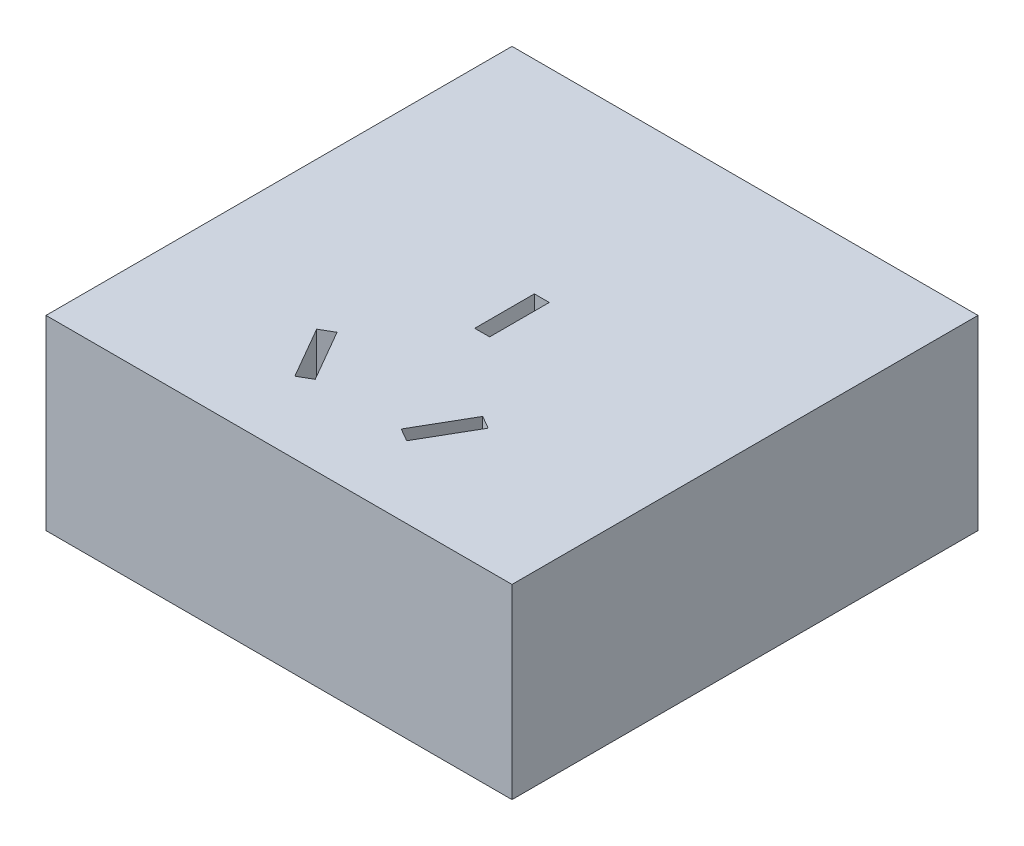
ISO-10303-21;
HEADER;
FILE_DESCRIPTION(('STEP AP214'),'2;1');
FILE_NAME('part.step','',(''),(''),'','','');
FILE_SCHEMA(('AUTOMOTIVE_DESIGN { 1 0 10303 214 1 1 1 1 }'));
ENDSEC;
DATA;
#1=APPLICATION_CONTEXT('core data for automotive mechanical design processes');
#2=APPLICATION_PROTOCOL_DEFINITION('international standard','automotive_design',2000,#1);
#3=PRODUCT_CONTEXT('',#1,'mechanical');
#4=PRODUCT('Part','Part','',(#3));
#5=PRODUCT_RELATED_PRODUCT_CATEGORY('part','',(#4));
#6=PRODUCT_DEFINITION_FORMATION('','',#4);
#7=PRODUCT_DEFINITION_CONTEXT('part definition',#1,'design');
#8=PRODUCT_DEFINITION('design','',#6,#7);
#9=PRODUCT_DEFINITION_SHAPE('','',#8);
#10=(LENGTH_UNIT() NAMED_UNIT(*) SI_UNIT(.MILLI.,.METRE.));
#11=(NAMED_UNIT(*) PLANE_ANGLE_UNIT() SI_UNIT($,.RADIAN.));
#12=(NAMED_UNIT(*) SI_UNIT($,.STERADIAN.) SOLID_ANGLE_UNIT());
#13=UNCERTAINTY_MEASURE_WITH_UNIT(LENGTH_MEASURE(1.E-05),#10,'distance_accuracy_value','');
#14=(GEOMETRIC_REPRESENTATION_CONTEXT(3) GLOBAL_UNCERTAINTY_ASSIGNED_CONTEXT((#13)) GLOBAL_UNIT_ASSIGNED_CONTEXT((#10,
#11,#12)) REPRESENTATION_CONTEXT('',''));
#15=CARTESIAN_POINT('',(0.,0.,0.));
#16=DIRECTION('',(0.,0.,1.));
#17=DIRECTION('',(1.,0.,0.));
#18=AXIS2_PLACEMENT_3D('',#15,#16,#17);
#19=CARTESIAN_POINT('',(25.,20.,-25.));
#20=DIRECTION('',(-1.,0.,0.));
#21=DIRECTION('',(0.,0.,1.));
#22=AXIS2_PLACEMENT_3D('',#19,#20,#21);
#23=PLANE('',#22);
#24=DIRECTION('',(0.,0.,-1.));
#25=VECTOR('',#24,1.);
#26=CARTESIAN_POINT('',(25.,0.,-25.));
#27=LINE('',#26,#25);
#28=CARTESIAN_POINT('',(25.,0.,25.));
#29=VERTEX_POINT('',#28);
#30=CARTESIAN_POINT('',(25.,0.,-25.));
#31=VERTEX_POINT('',#30);
#32=EDGE_CURVE('E198',#29,#31,#27,.T.);
#33=ORIENTED_EDGE('',*,*,#32,.T.);
#34=DIRECTION('',(0.,-1.,0.));
#35=VECTOR('',#34,1.);
#36=CARTESIAN_POINT('',(25.,20.,-25.));
#37=LINE('',#36,#35);
#38=CARTESIAN_POINT('',(25.,20.,-25.));
#39=VERTEX_POINT('',#38);
#40=EDGE_CURVE('E11',#39,#31,#37,.T.);
#41=ORIENTED_EDGE('',*,*,#40,.F.);
#42=DIRECTION('',(0.,0.,-1.));
#43=VECTOR('',#42,1.);
#44=CARTESIAN_POINT('',(25.,20.,-25.));
#45=LINE('',#44,#43);
#46=CARTESIAN_POINT('',(25.,20.,25.));
#47=VERTEX_POINT('',#46);
#48=EDGE_CURVE('E289',#47,#39,#45,.T.);
#49=ORIENTED_EDGE('',*,*,#48,.F.);
#50=DIRECTION('',(0.,-1.,0.));
#51=VECTOR('',#50,1.);
#52=CARTESIAN_POINT('',(25.,20.,25.));
#53=LINE('',#52,#51);
#54=EDGE_CURVE('E303',#47,#29,#53,.T.);
#55=ORIENTED_EDGE('',*,*,#54,.T.);
#56=EDGE_LOOP('',(#33,#41,#49,#55));
#57=FACE_BOUND('',#56,.T.);
#58=ADVANCED_FACE('F38',(#57),#23,.F.);
#59=CARTESIAN_POINT('',(-25.,20.,-25.));
#60=DIRECTION('',(0.,0.,1.));
#61=DIRECTION('',(1.,0.,0.));
#62=AXIS2_PLACEMENT_3D('',#59,#60,#61);
#63=PLANE('',#62);
#64=DIRECTION('',(-1.,0.,0.));
#65=VECTOR('',#64,1.);
#66=CARTESIAN_POINT('',(-25.,0.,-25.));
#67=LINE('',#66,#65);
#68=CARTESIAN_POINT('',(-25.,0.,-25.));
#69=VERTEX_POINT('',#68);
#70=EDGE_CURVE('E307',#31,#69,#67,.T.);
#71=ORIENTED_EDGE('',*,*,#70,.T.);
#72=DIRECTION('',(0.,-1.,0.));
#73=VECTOR('',#72,1.);
#74=CARTESIAN_POINT('',(-25.,20.,-25.));
#75=LINE('',#74,#73);
#76=CARTESIAN_POINT('',(-25.,20.,-25.));
#77=VERTEX_POINT('',#76);
#78=EDGE_CURVE('E46',#77,#69,#75,.T.);
#79=ORIENTED_EDGE('',*,*,#78,.F.);
#80=DIRECTION('',(-1.,0.,0.));
#81=VECTOR('',#80,1.);
#82=CARTESIAN_POINT('',(-25.,20.,-25.));
#83=LINE('',#82,#81);
#84=EDGE_CURVE('E293',#39,#77,#83,.T.);
#85=ORIENTED_EDGE('',*,*,#84,.F.);
#86=ORIENTED_EDGE('',*,*,#40,.T.);
#87=EDGE_LOOP('',(#71,#79,#85,#86));
#88=FACE_BOUND('',#87,.T.);
#89=ADVANCED_FACE('F342',(#88),#63,.F.);
#90=CARTESIAN_POINT('',(-25.,20.,-25.));
#91=DIRECTION('',(1.,0.,0.));
#92=DIRECTION('',(0.,0.,-1.));
#93=AXIS2_PLACEMENT_3D('',#90,#91,#92);
#94=PLANE('',#93);
#95=DIRECTION('',(0.,0.,1.));
#96=VECTOR('',#95,1.);
#97=CARTESIAN_POINT('',(-25.,0.,-25.));
#98=LINE('',#97,#96);
#99=CARTESIAN_POINT('',(-25.,0.,25.));
#100=VERTEX_POINT('',#99);
#101=EDGE_CURVE('E310',#69,#100,#98,.T.);
#102=ORIENTED_EDGE('',*,*,#101,.T.);
#103=DIRECTION('',(0.,-1.,0.));
#104=VECTOR('',#103,1.);
#105=CARTESIAN_POINT('',(-25.,20.,25.));
#106=LINE('',#105,#104);
#107=CARTESIAN_POINT('',(-25.,20.,25.));
#108=VERTEX_POINT('',#107);
#109=EDGE_CURVE('E318',#108,#100,#106,.T.);
#110=ORIENTED_EDGE('',*,*,#109,.F.);
#111=DIRECTION('',(0.,0.,1.));
#112=VECTOR('',#111,1.);
#113=CARTESIAN_POINT('',(-25.,20.,-25.));
#114=LINE('',#113,#112);
#115=EDGE_CURVE('E297',#77,#108,#114,.T.);
#116=ORIENTED_EDGE('',*,*,#115,.F.);
#117=ORIENTED_EDGE('',*,*,#78,.T.);
#118=EDGE_LOOP('',(#102,#110,#116,#117));
#119=FACE_BOUND('',#118,.T.);
#120=ADVANCED_FACE('F327',(#119),#94,.F.);
#121=CARTESIAN_POINT('',(-25.,20.,25.));
#122=DIRECTION('',(0.,0.,-1.));
#123=DIRECTION('',(-1.,0.,0.));
#124=AXIS2_PLACEMENT_3D('',#121,#122,#123);
#125=PLANE('',#124);
#126=DIRECTION('',(1.,0.,0.));
#127=VECTOR('',#126,1.);
#128=CARTESIAN_POINT('',(-25.,0.,25.));
#129=LINE('',#128,#127);
#130=EDGE_CURVE('E294',#100,#29,#129,.T.);
#131=ORIENTED_EDGE('',*,*,#130,.T.);
#132=ORIENTED_EDGE('',*,*,#54,.F.);
#133=DIRECTION('',(1.,0.,0.));
#134=VECTOR('',#133,1.);
#135=CARTESIAN_POINT('',(-25.,20.,25.));
#136=LINE('',#135,#134);
#137=EDGE_CURVE('E300',#108,#47,#136,.T.);
#138=ORIENTED_EDGE('',*,*,#137,.F.);
#139=ORIENTED_EDGE('',*,*,#109,.T.);
#140=EDGE_LOOP('',(#131,#132,#138,#139));
#141=FACE_BOUND('',#140,.T.);
#142=ADVANCED_FACE('F335',(#141),#125,.F.);
#143=CARTESIAN_POINT('',(0.,20.,0.));
#144=DIRECTION('',(0.,1.,0.));
#145=DIRECTION('',(0.,0.,1.));
#146=AXIS2_PLACEMENT_3D('',#143,#144,#145);
#147=PLANE('',#146);
#148=DIRECTION('',(0.,0.,-1.));
#149=VECTOR('',#148,1.);
#150=CARTESIAN_POINT('',(0.8,20.,-3.2));
#151=LINE('',#150,#149);
#152=CARTESIAN_POINT('',(0.800000000000001,20.,3.2));
#153=VERTEX_POINT('',#152);
#154=CARTESIAN_POINT('',(0.8,20.,-3.2));
#155=VERTEX_POINT('',#154);
#156=EDGE_CURVE('E53',#153,#155,#151,.T.);
#157=ORIENTED_EDGE('',*,*,#156,.F.);
#158=DIRECTION('',(1.,0.,0.));
#159=VECTOR('',#158,1.);
#160=CARTESIAN_POINT('',(0.800000000000001,20.,3.2));
#161=LINE('',#160,#159);
#162=CARTESIAN_POINT('',(-0.799999999999995,20.,3.2));
#163=VERTEX_POINT('',#162);
#164=EDGE_CURVE('E175',#163,#153,#161,.T.);
#165=ORIENTED_EDGE('',*,*,#164,.F.);
#166=DIRECTION('',(0.,0.,1.));
#167=VECTOR('',#166,1.);
#168=CARTESIAN_POINT('',(-0.8,20.,-3.2));
#169=LINE('',#168,#167);
#170=CARTESIAN_POINT('',(-0.8,20.,-3.2));
#171=VERTEX_POINT('',#170);
#172=EDGE_CURVE('E179',#171,#163,#169,.T.);
#173=ORIENTED_EDGE('',*,*,#172,.F.);
#174=DIRECTION('',(-1.,0.,0.));
#175=VECTOR('',#174,1.);
#176=CARTESIAN_POINT('',(-0.8,20.,-3.2));
#177=LINE('',#176,#175);
#178=EDGE_CURVE('E188',#155,#171,#177,.T.);
#179=ORIENTED_EDGE('',*,*,#178,.F.);
#180=EDGE_LOOP('',(#157,#165,#173,#179));
#181=FACE_BOUND('',#180,.T.);
#182=DIRECTION('',(0.866025403784439,0.,0.499999999999999));
#183=VECTOR('',#182,1.);
#184=CARTESIAN_POINT('',(6.,20.,17.3));
#185=LINE('',#184,#183);
#186=CARTESIAN_POINT('',(4.6143593539449,20.,16.5));
#187=VERTEX_POINT('',#186);
#188=CARTESIAN_POINT('',(6.,20.,17.3));
#189=VERTEX_POINT('',#188);
#190=EDGE_CURVE('E61',#187,#189,#185,.T.);
#191=ORIENTED_EDGE('',*,*,#190,.F.);
#192=DIRECTION('',(-0.5,0.,0.866025403784439));
#193=VECTOR('',#192,1.);
#194=CARTESIAN_POINT('',(4.6143593539449,20.,16.5));
#195=LINE('',#194,#193);
#196=CARTESIAN_POINT('',(7.81435935394489,20.,10.9574374157796));
#197=VERTEX_POINT('',#196);
#198=EDGE_CURVE('E209',#197,#187,#195,.T.);
#199=ORIENTED_EDGE('',*,*,#198,.F.);
#200=DIRECTION('',(-0.866025403784439,0.,-0.5));
#201=VECTOR('',#200,1.);
#202=CARTESIAN_POINT('',(7.81435935394489,20.,10.9574374157796));
#203=LINE('',#202,#201);
#204=CARTESIAN_POINT('',(9.2,20.,11.7574374157796));
#205=VERTEX_POINT('',#204);
#206=EDGE_CURVE('E229',#205,#197,#203,.T.);
#207=ORIENTED_EDGE('',*,*,#206,.F.);
#208=DIRECTION('',(0.5,0.,-0.866025403784439));
#209=VECTOR('',#208,1.);
#210=CARTESIAN_POINT('',(9.2,20.,11.7574374157796));
#211=LINE('',#210,#209);
#212=EDGE_CURVE('E224',#189,#205,#211,.T.);
#213=ORIENTED_EDGE('',*,*,#212,.F.);
#214=EDGE_LOOP('',(#191,#199,#207,#213));
#215=FACE_BOUND('',#214,.T.);
#216=DIRECTION('',(0.5,0.,0.866025403784439));
#217=VECTOR('',#216,1.);
#218=CARTESIAN_POINT('',(-9.2,20.,11.7574374157796));
#219=LINE('',#218,#217);
#220=CARTESIAN_POINT('',(-9.2,20.,11.7574374157796));
#221=VERTEX_POINT('',#220);
#222=CARTESIAN_POINT('',(-6.,20.,17.3));
#223=VERTEX_POINT('',#222);
#224=EDGE_CURVE('E264',#221,#223,#219,.T.);
#225=ORIENTED_EDGE('',*,*,#224,.F.);
#226=DIRECTION('',(-0.866025403784439,0.,0.5));
#227=VECTOR('',#226,1.);
#228=CARTESIAN_POINT('',(-7.81435935394489,20.,10.9574374157796));
#229=LINE('',#228,#227);
#230=CARTESIAN_POINT('',(-7.81435935394489,20.,10.9574374157796));
#231=VERTEX_POINT('',#230);
#232=EDGE_CURVE('E251',#231,#221,#229,.T.);
#233=ORIENTED_EDGE('',*,*,#232,.F.);
#234=DIRECTION('',(-0.5,0.,-0.866025403784439));
#235=VECTOR('',#234,1.);
#236=CARTESIAN_POINT('',(-4.6143593539449,20.,16.5));
#237=LINE('',#236,#235);
#238=CARTESIAN_POINT('',(-4.6143593539449,20.,16.5));
#239=VERTEX_POINT('',#238);
#240=EDGE_CURVE('E271',#239,#231,#237,.T.);
#241=ORIENTED_EDGE('',*,*,#240,.F.);
#242=DIRECTION('',(0.866025403784439,0.,-0.499999999999999));
#243=VECTOR('',#242,1.);
#244=CARTESIAN_POINT('',(-6.,20.,17.3));
#245=LINE('',#244,#243);
#246=EDGE_CURVE('E267',#223,#239,#245,.T.);
#247=ORIENTED_EDGE('',*,*,#246,.F.);
#248=EDGE_LOOP('',(#225,#233,#241,#247));
#249=FACE_BOUND('',#248,.T.);
#250=ORIENTED_EDGE('',*,*,#48,.T.);
#251=ORIENTED_EDGE('',*,*,#84,.T.);
#252=ORIENTED_EDGE('',*,*,#115,.T.);
#253=ORIENTED_EDGE('',*,*,#137,.T.);
#254=EDGE_LOOP('',(#250,#251,#252,#253));
#255=FACE_BOUND('',#254,.T.);
#256=ADVANCED_FACE('F341',(#181,#215,#249,#255),#147,.T.);
#257=CARTESIAN_POINT('',(0.,0.,0.));
#258=DIRECTION('',(0.,1.,0.));
#259=DIRECTION('',(0.,0.,1.));
#260=AXIS2_PLACEMENT_3D('',#257,#258,#259);
#261=PLANE('',#260);
#262=DIRECTION('',(1.,0.,0.));
#263=VECTOR('',#262,1.);
#264=CARTESIAN_POINT('',(-0.799999999999995,0.,3.2));
#265=LINE('',#264,#263);
#266=CARTESIAN_POINT('',(-0.799999999999995,0.,3.2));
#267=VERTEX_POINT('',#266);
#268=CARTESIAN_POINT('',(0.800000000000001,0.,3.2));
#269=VERTEX_POINT('',#268);
#270=EDGE_CURVE('E160',#267,#269,#265,.T.);
#271=ORIENTED_EDGE('',*,*,#270,.T.);
#272=DIRECTION('',(0.,0.,-1.));
#273=VECTOR('',#272,1.);
#274=CARTESIAN_POINT('',(0.8,0.,-3.2));
#275=LINE('',#274,#273);
#276=CARTESIAN_POINT('',(0.8,0.,-3.2));
#277=VERTEX_POINT('',#276);
#278=EDGE_CURVE('E153',#269,#277,#275,.T.);
#279=ORIENTED_EDGE('',*,*,#278,.T.);
#280=DIRECTION('',(-1.,0.,0.));
#281=VECTOR('',#280,1.);
#282=CARTESIAN_POINT('',(-0.8,0.,-3.2));
#283=LINE('',#282,#281);
#284=CARTESIAN_POINT('',(-0.8,0.,-3.2));
#285=VERTEX_POINT('',#284);
#286=EDGE_CURVE('E164',#277,#285,#283,.T.);
#287=ORIENTED_EDGE('',*,*,#286,.T.);
#288=DIRECTION('',(0.,0.,1.));
#289=VECTOR('',#288,1.);
#290=CARTESIAN_POINT('',(-0.8,0.,-3.2));
#291=LINE('',#290,#289);
#292=EDGE_CURVE('E169',#285,#267,#291,.T.);
#293=ORIENTED_EDGE('',*,*,#292,.T.);
#294=EDGE_LOOP('',(#271,#279,#287,#293));
#295=FACE_BOUND('',#294,.T.);
#296=DIRECTION('',(-0.5,0.,0.866025403784439));
#297=VECTOR('',#296,1.);
#298=CARTESIAN_POINT('',(4.6143593539449,0.,16.5));
#299=LINE('',#298,#297);
#300=CARTESIAN_POINT('',(7.81435935394489,0.,10.9574374157796));
#301=VERTEX_POINT('',#300);
#302=CARTESIAN_POINT('',(4.6143593539449,0.,16.5));
#303=VERTEX_POINT('',#302);
#304=EDGE_CURVE('E217',#301,#303,#299,.T.);
#305=ORIENTED_EDGE('',*,*,#304,.T.);
#306=DIRECTION('',(0.866025403784439,0.,0.499999999999999));
#307=VECTOR('',#306,1.);
#308=CARTESIAN_POINT('',(6.,0.,17.3));
#309=LINE('',#308,#307);
#310=CARTESIAN_POINT('',(6.,0.,17.3));
#311=VERTEX_POINT('',#310);
#312=EDGE_CURVE('E204',#303,#311,#309,.T.);
#313=ORIENTED_EDGE('',*,*,#312,.T.);
#314=DIRECTION('',(0.5,0.,-0.866025403784439));
#315=VECTOR('',#314,1.);
#316=CARTESIAN_POINT('',(9.2,0.,11.7574374157796));
#317=LINE('',#316,#315);
#318=CARTESIAN_POINT('',(9.2,0.,11.7574374157796));
#319=VERTEX_POINT('',#318);
#320=EDGE_CURVE('E208',#311,#319,#317,.T.);
#321=ORIENTED_EDGE('',*,*,#320,.T.);
#322=DIRECTION('',(-0.866025403784439,0.,-0.5));
#323=VECTOR('',#322,1.);
#324=CARTESIAN_POINT('',(7.81435935394489,0.,10.9574374157796));
#325=LINE('',#324,#323);
#326=EDGE_CURVE('E213',#319,#301,#325,.T.);
#327=ORIENTED_EDGE('',*,*,#326,.T.);
#328=EDGE_LOOP('',(#305,#313,#321,#327));
#329=FACE_BOUND('',#328,.T.);
#330=DIRECTION('',(-0.866025403784439,0.,0.5));
#331=VECTOR('',#330,1.);
#332=CARTESIAN_POINT('',(-7.81435935394489,0.,10.9574374157796));
#333=LINE('',#332,#331);
#334=CARTESIAN_POINT('',(-7.81435935394489,0.,10.9574374157796));
#335=VERTEX_POINT('',#334);
#336=CARTESIAN_POINT('',(-9.2,0.,11.7574374157796));
#337=VERTEX_POINT('',#336);
#338=EDGE_CURVE('E259',#335,#337,#333,.T.);
#339=ORIENTED_EDGE('',*,*,#338,.T.);
#340=DIRECTION('',(0.5,0.,0.866025403784439));
#341=VECTOR('',#340,1.);
#342=CARTESIAN_POINT('',(-9.2,0.,11.7574374157796));
#343=LINE('',#342,#341);
#344=CARTESIAN_POINT('',(-6.,0.,17.3));
#345=VERTEX_POINT('',#344);
#346=EDGE_CURVE('E246',#337,#345,#343,.T.);
#347=ORIENTED_EDGE('',*,*,#346,.T.);
#348=DIRECTION('',(0.866025403784439,0.,-0.499999999999999));
#349=VECTOR('',#348,1.);
#350=CARTESIAN_POINT('',(-6.,0.,17.3));
#351=LINE('',#350,#349);
#352=CARTESIAN_POINT('',(-4.6143593539449,0.,16.5));
#353=VERTEX_POINT('',#352);
#354=EDGE_CURVE('E250',#345,#353,#351,.T.);
#355=ORIENTED_EDGE('',*,*,#354,.T.);
#356=DIRECTION('',(-0.5,0.,-0.866025403784439));
#357=VECTOR('',#356,1.);
#358=CARTESIAN_POINT('',(-4.6143593539449,0.,16.5));
#359=LINE('',#358,#357);
#360=EDGE_CURVE('E255',#353,#335,#359,.T.);
#361=ORIENTED_EDGE('',*,*,#360,.T.);
#362=EDGE_LOOP('',(#339,#347,#355,#361));
#363=FACE_BOUND('',#362,.T.);
#364=ORIENTED_EDGE('',*,*,#32,.F.);
#365=ORIENTED_EDGE('',*,*,#130,.F.);
#366=ORIENTED_EDGE('',*,*,#101,.F.);
#367=ORIENTED_EDGE('',*,*,#70,.F.);
#368=EDGE_LOOP('',(#364,#365,#366,#367));
#369=FACE_BOUND('',#368,.T.);
#370=ADVANCED_FACE('F171',(#295,#329,#363,#369),#261,.F.);
#371=CARTESIAN_POINT('',(-9.2,0.,11.7574374157796));
#372=DIRECTION('',(-0.866025403784439,0.,0.5));
#373=DIRECTION('',(0.5,0.,0.866025403784439));
#374=AXIS2_PLACEMENT_3D('',#371,#372,#373);
#375=PLANE('',#374);
#376=ORIENTED_EDGE('',*,*,#224,.T.);
#377=DIRECTION('',(0.,1.,0.));
#378=VECTOR('',#377,1.);
#379=CARTESIAN_POINT('',(-6.,0.,17.3));
#380=LINE('',#379,#378);
#381=EDGE_CURVE('E263',#345,#223,#380,.T.);
#382=ORIENTED_EDGE('',*,*,#381,.F.);
#383=ORIENTED_EDGE('',*,*,#346,.F.);
#384=DIRECTION('',(0.,1.,0.));
#385=VECTOR('',#384,1.);
#386=CARTESIAN_POINT('',(-9.2,0.,11.7574374157796));
#387=LINE('',#386,#385);
#388=EDGE_CURVE('E225',#337,#221,#387,.T.);
#389=ORIENTED_EDGE('',*,*,#388,.T.);
#390=EDGE_LOOP('',(#376,#382,#383,#389));
#391=FACE_BOUND('',#390,.T.);
#392=ADVANCED_FACE('F354',(#391),#375,.F.);
#393=CARTESIAN_POINT('',(-7.81435935394489,0.,10.9574374157796));
#394=DIRECTION('',(-0.5,0.,-0.866025403784439));
#395=DIRECTION('',(-0.866025403784439,0.,0.5));
#396=AXIS2_PLACEMENT_3D('',#393,#394,#395);
#397=PLANE('',#396);
#398=ORIENTED_EDGE('',*,*,#232,.T.);
#399=ORIENTED_EDGE('',*,*,#388,.F.);
#400=ORIENTED_EDGE('',*,*,#338,.F.);
#401=DIRECTION('',(0.,1.,0.));
#402=VECTOR('',#401,1.);
#403=CARTESIAN_POINT('',(-7.81435935394489,0.,10.9574374157796));
#404=LINE('',#403,#402);
#405=EDGE_CURVE('E280',#335,#231,#404,.T.);
#406=ORIENTED_EDGE('',*,*,#405,.T.);
#407=EDGE_LOOP('',(#398,#399,#400,#406));
#408=FACE_BOUND('',#407,.T.);
#409=ADVANCED_FACE('F360',(#408),#397,.F.);
#410=CARTESIAN_POINT('',(-4.6143593539449,0.,16.5));
#411=DIRECTION('',(0.866025403784439,0.,-0.5));
#412=DIRECTION('',(-0.5,0.,-0.866025403784439));
#413=AXIS2_PLACEMENT_3D('',#410,#411,#412);
#414=PLANE('',#413);
#415=ORIENTED_EDGE('',*,*,#240,.T.);
#416=ORIENTED_EDGE('',*,*,#405,.F.);
#417=ORIENTED_EDGE('',*,*,#360,.F.);
#418=DIRECTION('',(0.,1.,0.));
#419=VECTOR('',#418,1.);
#420=CARTESIAN_POINT('',(-4.6143593539449,0.,16.5));
#421=LINE('',#420,#419);
#422=EDGE_CURVE('E283',#353,#239,#421,.T.);
#423=ORIENTED_EDGE('',*,*,#422,.T.);
#424=EDGE_LOOP('',(#415,#416,#417,#423));
#425=FACE_BOUND('',#424,.T.);
#426=ADVANCED_FACE('F366',(#425),#414,.F.);
#427=CARTESIAN_POINT('',(-6.,0.,17.3));
#428=DIRECTION('',(0.499999999999999,0.,0.866025403784439));
#429=DIRECTION('',(0.866025403784439,0.,-0.499999999999999));
#430=AXIS2_PLACEMENT_3D('',#427,#428,#429);
#431=PLANE('',#430);
#432=ORIENTED_EDGE('',*,*,#246,.T.);
#433=ORIENTED_EDGE('',*,*,#422,.F.);
#434=ORIENTED_EDGE('',*,*,#354,.F.);
#435=ORIENTED_EDGE('',*,*,#381,.T.);
#436=EDGE_LOOP('',(#432,#433,#434,#435));
#437=FACE_BOUND('',#436,.T.);
#438=ADVANCED_FACE('F362',(#437),#431,.F.);
#439=CARTESIAN_POINT('',(6.,0.,17.3));
#440=DIRECTION('',(-0.499999999999999,0.,0.866025403784439));
#441=DIRECTION('',(0.866025403784439,0.,0.499999999999999));
#442=AXIS2_PLACEMENT_3D('',#439,#440,#441);
#443=PLANE('',#442);
#444=ORIENTED_EDGE('',*,*,#190,.T.);
#445=DIRECTION('',(0.,1.,0.));
#446=VECTOR('',#445,1.);
#447=CARTESIAN_POINT('',(6.,0.,17.3));
#448=LINE('',#447,#446);
#449=EDGE_CURVE('E221',#311,#189,#448,.T.);
#450=ORIENTED_EDGE('',*,*,#449,.F.);
#451=ORIENTED_EDGE('',*,*,#312,.F.);
#452=DIRECTION('',(0.,1.,0.));
#453=VECTOR('',#452,1.);
#454=CARTESIAN_POINT('',(4.6143593539449,0.,16.5));
#455=LINE('',#454,#453);
#456=EDGE_CURVE('E189',#303,#187,#455,.T.);
#457=ORIENTED_EDGE('',*,*,#456,.T.);
#458=EDGE_LOOP('',(#444,#450,#451,#457));
#459=FACE_BOUND('',#458,.T.);
#460=ADVANCED_FACE('F365',(#459),#443,.F.);
#461=CARTESIAN_POINT('',(4.6143593539449,0.,16.5));
#462=DIRECTION('',(-0.866025403784439,0.,-0.5));
#463=DIRECTION('',(-0.5,0.,0.866025403784439));
#464=AXIS2_PLACEMENT_3D('',#461,#462,#463);
#465=PLANE('',#464);
#466=ORIENTED_EDGE('',*,*,#198,.T.);
#467=ORIENTED_EDGE('',*,*,#456,.F.);
#468=ORIENTED_EDGE('',*,*,#304,.F.);
#469=DIRECTION('',(0.,1.,0.));
#470=VECTOR('',#469,1.);
#471=CARTESIAN_POINT('',(7.81435935394489,0.,10.9574374157796));
#472=LINE('',#471,#470);
#473=EDGE_CURVE('E238',#301,#197,#472,.T.);
#474=ORIENTED_EDGE('',*,*,#473,.T.);
#475=EDGE_LOOP('',(#466,#467,#468,#474));
#476=FACE_BOUND('',#475,.T.);
#477=ADVANCED_FACE('F376',(#476),#465,.F.);
#478=CARTESIAN_POINT('',(7.81435935394489,0.,10.9574374157796));
#479=DIRECTION('',(0.5,0.,-0.866025403784439));
#480=DIRECTION('',(-0.866025403784439,0.,-0.5));
#481=AXIS2_PLACEMENT_3D('',#478,#479,#480);
#482=PLANE('',#481);
#483=ORIENTED_EDGE('',*,*,#206,.T.);
#484=ORIENTED_EDGE('',*,*,#473,.F.);
#485=ORIENTED_EDGE('',*,*,#326,.F.);
#486=DIRECTION('',(0.,1.,0.));
#487=VECTOR('',#486,1.);
#488=CARTESIAN_POINT('',(9.2,0.,11.7574374157796));
#489=LINE('',#488,#487);
#490=EDGE_CURVE('E241',#319,#205,#489,.T.);
#491=ORIENTED_EDGE('',*,*,#490,.T.);
#492=EDGE_LOOP('',(#483,#484,#485,#491));
#493=FACE_BOUND('',#492,.T.);
#494=ADVANCED_FACE('F380',(#493),#482,.F.);
#495=CARTESIAN_POINT('',(9.2,0.,11.7574374157796));
#496=DIRECTION('',(0.866025403784439,0.,0.5));
#497=DIRECTION('',(0.5,0.,-0.866025403784439));
#498=AXIS2_PLACEMENT_3D('',#495,#496,#497);
#499=PLANE('',#498);
#500=ORIENTED_EDGE('',*,*,#212,.T.);
#501=ORIENTED_EDGE('',*,*,#490,.F.);
#502=ORIENTED_EDGE('',*,*,#320,.F.);
#503=ORIENTED_EDGE('',*,*,#449,.T.);
#504=EDGE_LOOP('',(#500,#501,#502,#503));
#505=FACE_BOUND('',#504,.T.);
#506=ADVANCED_FACE('F377',(#505),#499,.F.);
#507=CARTESIAN_POINT('',(0.8,0.,-3.2));
#508=DIRECTION('',(1.,0.,0.));
#509=DIRECTION('',(0.,0.,-1.));
#510=AXIS2_PLACEMENT_3D('',#507,#508,#509);
#511=PLANE('',#510);
#512=ORIENTED_EDGE('',*,*,#156,.T.);
#513=DIRECTION('',(0.,1.,0.));
#514=VECTOR('',#513,1.);
#515=CARTESIAN_POINT('',(0.8,0.,-3.2));
#516=LINE('',#515,#514);
#517=EDGE_CURVE('E149',#277,#155,#516,.T.);
#518=ORIENTED_EDGE('',*,*,#517,.F.);
#519=ORIENTED_EDGE('',*,*,#278,.F.);
#520=DIRECTION('',(0.,1.,0.));
#521=VECTOR('',#520,1.);
#522=CARTESIAN_POINT('',(0.800000000000001,0.,3.2));
#523=LINE('',#522,#521);
#524=EDGE_CURVE('E195',#269,#153,#523,.T.);
#525=ORIENTED_EDGE('',*,*,#524,.T.);
#526=EDGE_LOOP('',(#512,#518,#519,#525));
#527=FACE_BOUND('',#526,.T.);
#528=ADVANCED_FACE('F151',(#527),#511,.F.);
#529=CARTESIAN_POINT('',(0.800000000000001,0.,3.2));
#530=DIRECTION('',(0.,0.,1.));
#531=DIRECTION('',(1.,0.,0.));
#532=AXIS2_PLACEMENT_3D('',#529,#530,#531);
#533=PLANE('',#532);
#534=ORIENTED_EDGE('',*,*,#164,.T.);
#535=ORIENTED_EDGE('',*,*,#524,.F.);
#536=ORIENTED_EDGE('',*,*,#270,.F.);
#537=DIRECTION('',(0.,1.,0.));
#538=VECTOR('',#537,1.);
#539=CARTESIAN_POINT('',(-0.799999999999995,0.,3.2));
#540=LINE('',#539,#538);
#541=EDGE_CURVE('E199',#267,#163,#540,.T.);
#542=ORIENTED_EDGE('',*,*,#541,.T.);
#543=EDGE_LOOP('',(#534,#535,#536,#542));
#544=FACE_BOUND('',#543,.T.);
#545=ADVANCED_FACE('F390',(#544),#533,.F.);
#546=CARTESIAN_POINT('',(-0.8,0.,-3.2));
#547=DIRECTION('',(-1.,0.,0.));
#548=DIRECTION('',(0.,0.,1.));
#549=AXIS2_PLACEMENT_3D('',#546,#547,#548);
#550=PLANE('',#549);
#551=ORIENTED_EDGE('',*,*,#172,.T.);
#552=ORIENTED_EDGE('',*,*,#541,.F.);
#553=ORIENTED_EDGE('',*,*,#292,.F.);
#554=DIRECTION('',(0.,1.,0.));
#555=VECTOR('',#554,1.);
#556=CARTESIAN_POINT('',(-0.8,0.,-3.2));
#557=LINE('',#556,#555);
#558=EDGE_CURVE('E159',#285,#171,#557,.T.);
#559=ORIENTED_EDGE('',*,*,#558,.T.);
#560=EDGE_LOOP('',(#551,#552,#553,#559));
#561=FACE_BOUND('',#560,.T.);
#562=ADVANCED_FACE('F393',(#561),#550,.F.);
#563=CARTESIAN_POINT('',(-0.8,0.,-3.2));
#564=DIRECTION('',(0.,0.,-1.));
#565=DIRECTION('',(-1.,0.,0.));
#566=AXIS2_PLACEMENT_3D('',#563,#564,#565);
#567=PLANE('',#566);
#568=ORIENTED_EDGE('',*,*,#178,.T.);
#569=ORIENTED_EDGE('',*,*,#558,.F.);
#570=ORIENTED_EDGE('',*,*,#286,.F.);
#571=ORIENTED_EDGE('',*,*,#517,.T.);
#572=EDGE_LOOP('',(#568,#569,#570,#571));
#573=FACE_BOUND('',#572,.T.);
#574=ADVANCED_FACE('F165',(#573),#567,.F.);
#575=CLOSED_SHELL('',(#58,#89,#120,#142,#256,#370,#392,#409,#426,#438,#460,#477,#494,#506,#528,
#545,#562,#574));
#576=MANIFOLD_SOLID_BREP('B2',#575);
#577=ADVANCED_BREP_SHAPE_REPRESENTATION('',(#18,#576),#14);
#578=SHAPE_DEFINITION_REPRESENTATION(#9,#577);
ENDSEC;
END-ISO-10303-21;
